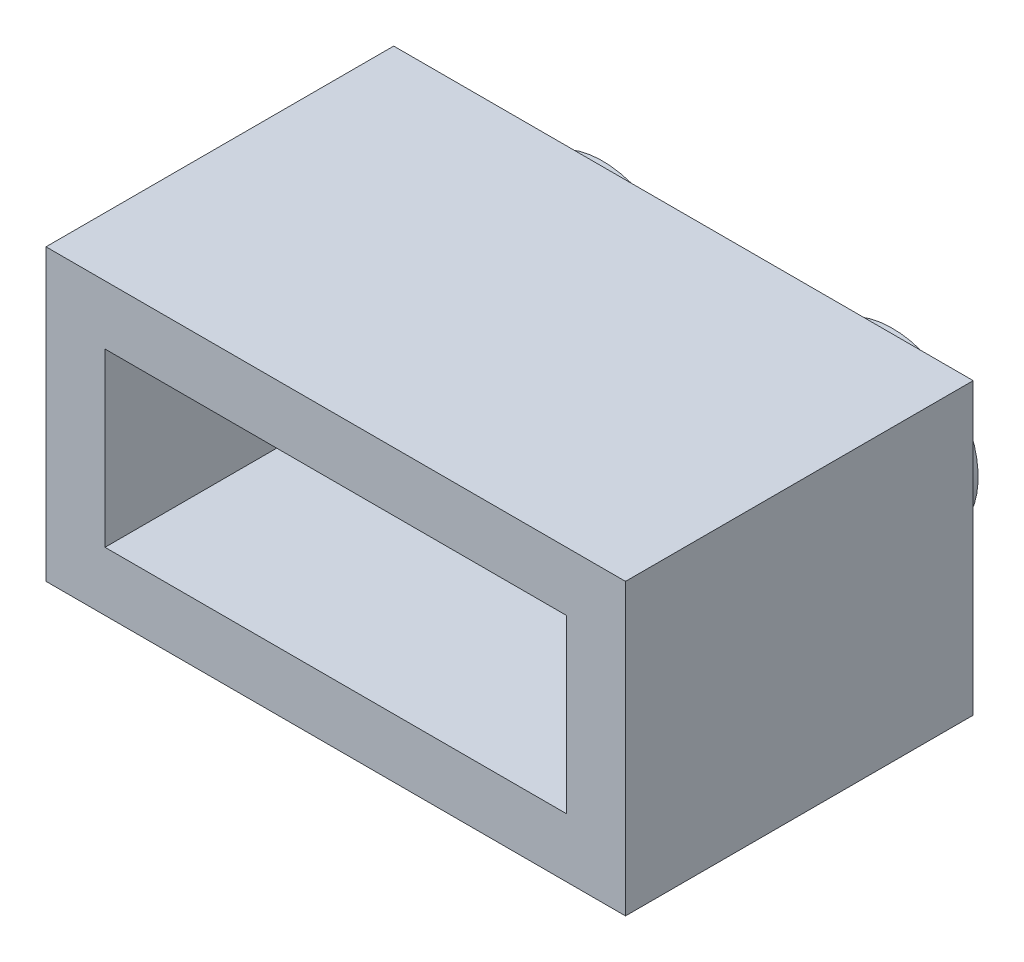
ISO-10303-21;
HEADER;
FILE_DESCRIPTION(('STEP AP214'),'2;1');
FILE_NAME('part.step','',(''),(''),'','','');
FILE_SCHEMA(('AUTOMOTIVE_DESIGN { 1 0 10303 214 1 1 1 1 }'));
ENDSEC;
DATA;
#1=APPLICATION_CONTEXT('core data for automotive mechanical design processes');
#2=APPLICATION_PROTOCOL_DEFINITION('international standard','automotive_design',2000,#1);
#3=PRODUCT_CONTEXT('',#1,'mechanical');
#4=PRODUCT('Part','Part','',(#3));
#5=PRODUCT_RELATED_PRODUCT_CATEGORY('part','',(#4));
#6=PRODUCT_DEFINITION_FORMATION('','',#4);
#7=PRODUCT_DEFINITION_CONTEXT('part definition',#1,'design');
#8=PRODUCT_DEFINITION('design','',#6,#7);
#9=PRODUCT_DEFINITION_SHAPE('','',#8);
#10=(LENGTH_UNIT() NAMED_UNIT(*) SI_UNIT(.MILLI.,.METRE.));
#11=(NAMED_UNIT(*) PLANE_ANGLE_UNIT() SI_UNIT($,.RADIAN.));
#12=(NAMED_UNIT(*) SI_UNIT($,.STERADIAN.) SOLID_ANGLE_UNIT());
#13=UNCERTAINTY_MEASURE_WITH_UNIT(LENGTH_MEASURE(1.E-05),#10,'distance_accuracy_value','');
#14=(GEOMETRIC_REPRESENTATION_CONTEXT(3) GLOBAL_UNCERTAINTY_ASSIGNED_CONTEXT((#13)) GLOBAL_UNIT_ASSIGNED_CONTEXT((#10,
#11,#12)) REPRESENTATION_CONTEXT('',''));
#15=CARTESIAN_POINT('',(0.,0.,0.));
#16=DIRECTION('',(0.,0.,1.));
#17=DIRECTION('',(1.,0.,0.));
#18=AXIS2_PLACEMENT_3D('',#15,#16,#17);
#19=CARTESIAN_POINT('',(8.065,-4.0325,-4.839));
#20=DIRECTION('',(0.,0.,-1.));
#21=DIRECTION('',(-1.,0.,0.));
#22=AXIS2_PLACEMENT_3D('',#19,#20,#21);
#23=PLANE('',#22);
#24=CARTESIAN_POINT('',(-4.0325,0.,-4.839));
#25=DIRECTION('',(0.,0.,-1.));
#26=DIRECTION('',(-1.,0.,0.));
#27=AXIS2_PLACEMENT_3D('',#24,#25,#26);
#28=CIRCLE('',#27,1.6425);
#29=CARTESIAN_POINT('',(-5.675,0.,-4.839));
#30=VERTEX_POINT('',#29);
#31=EDGE_CURVE('E19',#30,#30,#28,.T.);
#32=ORIENTED_EDGE('',*,*,#31,.T.);
#33=EDGE_LOOP('',(#32));
#34=FACE_BOUND('',#33,.T.);
#35=ADVANCED_FACE('F16',(#34),#23,.T.);
#36=CARTESIAN_POINT('',(8.065,-4.0325,-4.839));
#37=DIRECTION('',(0.,0.,-1.));
#38=DIRECTION('',(-1.,0.,0.));
#39=AXIS2_PLACEMENT_3D('',#36,#37,#38);
#40=PLANE('',#39);
#41=CARTESIAN_POINT('',(4.0325,0.,-4.839));
#42=DIRECTION('',(0.,0.,-1.));
#43=DIRECTION('',(-1.,0.,0.));
#44=AXIS2_PLACEMENT_3D('',#41,#42,#43);
#45=CIRCLE('',#44,1.6425);
#46=CARTESIAN_POINT('',(2.39,0.,-4.839));
#47=VERTEX_POINT('',#46);
#48=EDGE_CURVE('E122',#47,#47,#45,.T.);
#49=ORIENTED_EDGE('',*,*,#48,.T.);
#50=EDGE_LOOP('',(#49));
#51=FACE_BOUND('',#50,.T.);
#52=ADVANCED_FACE('F133',(#51),#40,.T.);
#53=CARTESIAN_POINT('',(-4.0325,0.,-4.839));
#54=DIRECTION('',(0.,0.,-1.));
#55=DIRECTION('',(-1.,0.,0.));
#56=AXIS2_PLACEMENT_3D('',#53,#54,#55);
#57=CYLINDRICAL_SURFACE('',#56,1.6425);
#58=CARTESIAN_POINT('',(-4.0325,0.,-6.619));
#59=DIRECTION('',(0.,0.,-1.));
#60=DIRECTION('',(-1.,0.,0.));
#61=AXIS2_PLACEMENT_3D('',#58,#59,#60);
#62=CIRCLE('',#61,1.6425);
#63=CARTESIAN_POINT('',(-5.675,0.,-6.619));
#64=VERTEX_POINT('',#63);
#65=EDGE_CURVE('E120',#64,#64,#62,.F.);
#66=ORIENTED_EDGE('',*,*,#65,.F.);
#67=EDGE_LOOP('',(#66));
#68=FACE_BOUND('',#67,.T.);
#69=ORIENTED_EDGE('',*,*,#31,.F.);
#70=EDGE_LOOP('',(#69));
#71=FACE_BOUND('',#70,.T.);
#72=ADVANCED_FACE('F130',(#68,#71),#57,.F.);
#73=CARTESIAN_POINT('',(4.0325,0.,-4.839));
#74=DIRECTION('',(0.,0.,-1.));
#75=DIRECTION('',(-1.,0.,0.));
#76=AXIS2_PLACEMENT_3D('',#73,#74,#75);
#77=CYLINDRICAL_SURFACE('',#76,1.6425);
#78=CARTESIAN_POINT('',(4.0325,0.,-6.619));
#79=DIRECTION('',(0.,0.,-1.));
#80=DIRECTION('',(-1.,0.,0.));
#81=AXIS2_PLACEMENT_3D('',#78,#79,#80);
#82=CIRCLE('',#81,1.6425);
#83=CARTESIAN_POINT('',(2.39,0.,-6.619));
#84=VERTEX_POINT('',#83);
#85=EDGE_CURVE('E93',#84,#84,#82,.F.);
#86=ORIENTED_EDGE('',*,*,#85,.F.);
#87=EDGE_LOOP('',(#86));
#88=FACE_BOUND('',#87,.T.);
#89=ORIENTED_EDGE('',*,*,#48,.F.);
#90=EDGE_LOOP('',(#89));
#91=FACE_BOUND('',#90,.T.);
#92=ADVANCED_FACE('F132',(#88,#91),#77,.F.);
#93=CARTESIAN_POINT('',(8.065,-4.0325,-3.1965));
#94=DIRECTION('',(0.,0.,-1.));
#95=DIRECTION('',(-1.,0.,0.));
#96=AXIS2_PLACEMENT_3D('',#93,#94,#95);
#97=PLANE('',#96);
#98=DIRECTION('',(1.,0.,0.));
#99=VECTOR('',#98,1.);
#100=CARTESIAN_POINT('',(0.,2.39,-3.1965));
#101=LINE('',#100,#99);
#102=CARTESIAN_POINT('',(6.4225,2.39,-3.1965));
#103=VERTEX_POINT('',#102);
#104=CARTESIAN_POINT('',(-6.4225,2.39,-3.1965));
#105=VERTEX_POINT('',#104);
#106=EDGE_CURVE('E78',#103,#105,#101,.F.);
#107=ORIENTED_EDGE('',*,*,#106,.T.);
#108=DIRECTION('',(0.,1.,0.));
#109=VECTOR('',#108,1.);
#110=CARTESIAN_POINT('',(-6.4225,-4.0325,-3.1965));
#111=LINE('',#110,#109);
#112=CARTESIAN_POINT('',(-6.4225,-2.39,-3.1965));
#113=VERTEX_POINT('',#112);
#114=EDGE_CURVE('E85',#105,#113,#111,.F.);
#115=ORIENTED_EDGE('',*,*,#114,.T.);
#116=DIRECTION('',(1.,0.,0.));
#117=VECTOR('',#116,1.);
#118=CARTESIAN_POINT('',(0.,-2.39,-3.1965));
#119=LINE('',#118,#117);
#120=CARTESIAN_POINT('',(6.4225,-2.39,-3.1965));
#121=VERTEX_POINT('',#120);
#122=EDGE_CURVE('E362',#121,#113,#119,.F.);
#123=ORIENTED_EDGE('',*,*,#122,.F.);
#124=DIRECTION('',(0.,1.,0.));
#125=VECTOR('',#124,1.);
#126=CARTESIAN_POINT('',(6.4225,-4.0325,-3.1965));
#127=LINE('',#126,#125);
#128=EDGE_CURVE('E97',#121,#103,#127,.T.);
#129=ORIENTED_EDGE('',*,*,#128,.T.);
#130=EDGE_LOOP('',(#107,#115,#123,#129));
#131=FACE_BOUND('',#130,.T.);
#132=ADVANCED_FACE('F100',(#131),#97,.F.);
#133=CARTESIAN_POINT('',(0.,-4.0325,-6.619));
#134=DIRECTION('',(0.,0.,-1.));
#135=DIRECTION('',(-1.,0.,0.));
#136=AXIS2_PLACEMENT_3D('',#133,#134,#135);
#137=PLANE('',#136);
#138=ORIENTED_EDGE('',*,*,#65,.T.);
#139=EDGE_LOOP('',(#138));
#140=FACE_BOUND('',#139,.T.);
#141=CARTESIAN_POINT('',(-4.0325,0.,-6.619));
#142=DIRECTION('',(0.,0.,-1.));
#143=DIRECTION('',(-1.,0.,0.));
#144=AXIS2_PLACEMENT_3D('',#141,#142,#143);
#145=CIRCLE('',#144,2.39);
#146=CARTESIAN_POINT('',(-6.4225,0.,-6.619));
#147=VERTEX_POINT('',#146);
#148=EDGE_CURVE('E115',#147,#147,#145,.F.);
#149=ORIENTED_EDGE('',*,*,#148,.F.);
#150=EDGE_LOOP('',(#149));
#151=FACE_BOUND('',#150,.T.);
#152=ADVANCED_FACE('F195',(#140,#151),#137,.T.);
#153=CARTESIAN_POINT('',(0.,-4.0325,-6.619));
#154=DIRECTION('',(0.,0.,-1.));
#155=DIRECTION('',(-1.,0.,0.));
#156=AXIS2_PLACEMENT_3D('',#153,#154,#155);
#157=PLANE('',#156);
#158=ORIENTED_EDGE('',*,*,#85,.T.);
#159=EDGE_LOOP('',(#158));
#160=FACE_BOUND('',#159,.T.);
#161=CARTESIAN_POINT('',(4.0325,0.,-6.619));
#162=DIRECTION('',(0.,0.,-1.));
#163=DIRECTION('',(-1.,0.,0.));
#164=AXIS2_PLACEMENT_3D('',#161,#162,#163);
#165=CIRCLE('',#164,2.39);
#166=CARTESIAN_POINT('',(1.6425,0.,-6.619));
#167=VERTEX_POINT('',#166);
#168=EDGE_CURVE('E111',#167,#167,#165,.F.);
#169=ORIENTED_EDGE('',*,*,#168,.F.);
#170=EDGE_LOOP('',(#169));
#171=FACE_BOUND('',#170,.T.);
#172=ADVANCED_FACE('F192',(#160,#171),#157,.T.);
#173=CARTESIAN_POINT('',(-6.4225,-4.0325,-4.839));
#174=DIRECTION('',(-1.,0.,0.));
#175=DIRECTION('',(0.,0.,1.));
#176=AXIS2_PLACEMENT_3D('',#173,#174,#175);
#177=PLANE('',#176);
#178=ORIENTED_EDGE('',*,*,#114,.F.);
#179=DIRECTION('',(0.,0.,1.));
#180=VECTOR('',#179,1.);
#181=CARTESIAN_POINT('',(-6.4225,2.39,0.));
#182=LINE('',#181,#180);
#183=CARTESIAN_POINT('',(-6.4225,2.39,4.839));
#184=VERTEX_POINT('',#183);
#185=EDGE_CURVE('E88',#105,#184,#182,.T.);
#186=ORIENTED_EDGE('',*,*,#185,.T.);
#187=DIRECTION('',(0.,1.,0.));
#188=VECTOR('',#187,1.);
#189=CARTESIAN_POINT('',(-6.4225,-4.0325,4.839));
#190=LINE('',#189,#188);
#191=CARTESIAN_POINT('',(-6.4225,-2.39,4.839));
#192=VERTEX_POINT('',#191);
#193=EDGE_CURVE('E374',#192,#184,#190,.T.);
#194=ORIENTED_EDGE('',*,*,#193,.F.);
#195=DIRECTION('',(0.,0.,1.));
#196=VECTOR('',#195,1.);
#197=CARTESIAN_POINT('',(-6.4225,-2.39,0.));
#198=LINE('',#197,#196);
#199=EDGE_CURVE('E90',#113,#192,#198,.T.);
#200=ORIENTED_EDGE('',*,*,#199,.F.);
#201=EDGE_LOOP('',(#178,#186,#194,#200));
#202=FACE_BOUND('',#201,.T.);
#203=ADVANCED_FACE('F86',(#202),#177,.F.);
#204=CARTESIAN_POINT('',(0.,2.39,0.));
#205=DIRECTION('',(0.,1.,0.));
#206=DIRECTION('',(0.,0.,1.));
#207=AXIS2_PLACEMENT_3D('',#204,#205,#206);
#208=PLANE('',#207);
#209=ORIENTED_EDGE('',*,*,#106,.F.);
#210=DIRECTION('',(0.,0.,-1.));
#211=VECTOR('',#210,1.);
#212=CARTESIAN_POINT('',(6.4225,2.39,4.839));
#213=LINE('',#212,#211);
#214=CARTESIAN_POINT('',(6.4225,2.39,4.839));
#215=VERTEX_POINT('',#214);
#216=EDGE_CURVE('E361',#103,#215,#213,.F.);
#217=ORIENTED_EDGE('',*,*,#216,.T.);
#218=DIRECTION('',(1.,0.,0.));
#219=VECTOR('',#218,1.);
#220=CARTESIAN_POINT('',(-8.065,2.39,4.839));
#221=LINE('',#220,#219);
#222=EDGE_CURVE('E96',#184,#215,#221,.T.);
#223=ORIENTED_EDGE('',*,*,#222,.F.);
#224=ORIENTED_EDGE('',*,*,#185,.F.);
#225=EDGE_LOOP('',(#209,#217,#223,#224));
#226=FACE_BOUND('',#225,.T.);
#227=ADVANCED_FACE('F95',(#226),#208,.F.);
#228=CARTESIAN_POINT('',(6.4225,-4.0325,4.839));
#229=DIRECTION('',(1.,0.,0.));
#230=DIRECTION('',(0.,0.,-1.));
#231=AXIS2_PLACEMENT_3D('',#228,#229,#230);
#232=PLANE('',#231);
#233=ORIENTED_EDGE('',*,*,#128,.F.);
#234=DIRECTION('',(0.,0.,1.));
#235=VECTOR('',#234,1.);
#236=CARTESIAN_POINT('',(6.4225,-2.39,0.));
#237=LINE('',#236,#235);
#238=CARTESIAN_POINT('',(6.4225,-2.39,4.839));
#239=VERTEX_POINT('',#238);
#240=EDGE_CURVE('E359',#239,#121,#237,.F.);
#241=ORIENTED_EDGE('',*,*,#240,.F.);
#242=DIRECTION('',(0.,1.,0.));
#243=VECTOR('',#242,1.);
#244=CARTESIAN_POINT('',(6.4225,-4.0325,4.839));
#245=LINE('',#244,#243);
#246=EDGE_CURVE('E370',#215,#239,#245,.F.);
#247=ORIENTED_EDGE('',*,*,#246,.F.);
#248=ORIENTED_EDGE('',*,*,#216,.F.);
#249=EDGE_LOOP('',(#233,#241,#247,#248));
#250=FACE_BOUND('',#249,.T.);
#251=ADVANCED_FACE('F183',(#250),#232,.F.);
#252=CARTESIAN_POINT('',(0.,-2.39,0.));
#253=DIRECTION('',(0.,1.,0.));
#254=DIRECTION('',(0.,0.,1.));
#255=AXIS2_PLACEMENT_3D('',#252,#253,#254);
#256=PLANE('',#255);
#257=ORIENTED_EDGE('',*,*,#199,.T.);
#258=DIRECTION('',(1.,0.,0.));
#259=VECTOR('',#258,1.);
#260=CARTESIAN_POINT('',(-8.065,-2.39,4.839));
#261=LINE('',#260,#259);
#262=EDGE_CURVE('E364',#239,#192,#261,.F.);
#263=ORIENTED_EDGE('',*,*,#262,.F.);
#264=ORIENTED_EDGE('',*,*,#240,.T.);
#265=ORIENTED_EDGE('',*,*,#122,.T.);
#266=EDGE_LOOP('',(#257,#263,#264,#265));
#267=FACE_BOUND('',#266,.T.);
#268=ADVANCED_FACE('F179',(#267),#256,.T.);
#269=CARTESIAN_POINT('',(0.,4.0325,0.));
#270=DIRECTION('',(0.,1.,0.));
#271=DIRECTION('',(0.,0.,1.));
#272=AXIS2_PLACEMENT_3D('',#269,#270,#271);
#273=PLANE('',#272);
#274=DIRECTION('',(-1.,0.,0.));
#275=VECTOR('',#274,1.);
#276=CARTESIAN_POINT('',(8.065,4.0325,-4.839));
#277=LINE('',#276,#275);
#278=CARTESIAN_POINT('',(-8.065,4.0325,-4.839));
#279=VERTEX_POINT('',#278);
#280=CARTESIAN_POINT('',(8.065,4.0325,-4.839));
#281=VERTEX_POINT('',#280);
#282=EDGE_CURVE('E390',#279,#281,#277,.F.);
#283=ORIENTED_EDGE('',*,*,#282,.F.);
#284=DIRECTION('',(0.,0.,1.));
#285=VECTOR('',#284,1.);
#286=CARTESIAN_POINT('',(-8.065,4.0325,-4.839));
#287=LINE('',#286,#285);
#288=CARTESIAN_POINT('',(-8.065,4.0325,4.839));
#289=VERTEX_POINT('',#288);
#290=EDGE_CURVE('E114',#289,#279,#287,.F.);
#291=ORIENTED_EDGE('',*,*,#290,.F.);
#292=DIRECTION('',(1.,0.,0.));
#293=VECTOR('',#292,1.);
#294=CARTESIAN_POINT('',(-8.065,4.0325,4.839));
#295=LINE('',#294,#293);
#296=CARTESIAN_POINT('',(8.065,4.0325,4.839));
#297=VERTEX_POINT('',#296);
#298=EDGE_CURVE('E381',#297,#289,#295,.F.);
#299=ORIENTED_EDGE('',*,*,#298,.F.);
#300=DIRECTION('',(0.,0.,-1.));
#301=VECTOR('',#300,1.);
#302=CARTESIAN_POINT('',(8.065,4.0325,4.839));
#303=LINE('',#302,#301);
#304=EDGE_CURVE('E372',#281,#297,#303,.F.);
#305=ORIENTED_EDGE('',*,*,#304,.F.);
#306=EDGE_LOOP('',(#283,#291,#299,#305));
#307=FACE_BOUND('',#306,.T.);
#308=ADVANCED_FACE('F175',(#307),#273,.T.);
#309=CARTESIAN_POINT('',(-4.0325,0.,-4.839));
#310=DIRECTION('',(0.,0.,-1.));
#311=DIRECTION('',(-1.,0.,0.));
#312=AXIS2_PLACEMENT_3D('',#309,#310,#311);
#313=CYLINDRICAL_SURFACE('',#312,2.39);
#314=ORIENTED_EDGE('',*,*,#148,.T.);
#315=EDGE_LOOP('',(#314));
#316=FACE_BOUND('',#315,.T.);
#317=CARTESIAN_POINT('',(-4.0325,0.,-4.839));
#318=DIRECTION('',(0.,0.,-1.));
#319=DIRECTION('',(-1.,0.,0.));
#320=AXIS2_PLACEMENT_3D('',#317,#318,#319);
#321=CIRCLE('',#320,2.39);
#322=CARTESIAN_POINT('',(-6.4225,0.,-4.839));
#323=VERTEX_POINT('',#322);
#324=EDGE_CURVE('E108',#323,#323,#321,.F.);
#325=ORIENTED_EDGE('',*,*,#324,.F.);
#326=EDGE_LOOP('',(#325));
#327=FACE_BOUND('',#326,.T.);
#328=ADVANCED_FACE('F171',(#316,#327),#313,.T.);
#329=CARTESIAN_POINT('',(4.0325,0.,-4.839));
#330=DIRECTION('',(0.,0.,-1.));
#331=DIRECTION('',(-1.,0.,0.));
#332=AXIS2_PLACEMENT_3D('',#329,#330,#331);
#333=CYLINDRICAL_SURFACE('',#332,2.39);
#334=ORIENTED_EDGE('',*,*,#168,.T.);
#335=EDGE_LOOP('',(#334));
#336=FACE_BOUND('',#335,.T.);
#337=CARTESIAN_POINT('',(4.0325,0.,-4.839));
#338=DIRECTION('',(0.,0.,-1.));
#339=DIRECTION('',(-1.,0.,0.));
#340=AXIS2_PLACEMENT_3D('',#337,#338,#339);
#341=CIRCLE('',#340,2.39);
#342=CARTESIAN_POINT('',(1.6425,0.,-4.839));
#343=VERTEX_POINT('',#342);
#344=EDGE_CURVE('E104',#343,#343,#341,.F.);
#345=ORIENTED_EDGE('',*,*,#344,.F.);
#346=EDGE_LOOP('',(#345));
#347=FACE_BOUND('',#346,.T.);
#348=ADVANCED_FACE('F167',(#336,#347),#333,.T.);
#349=CARTESIAN_POINT('',(-8.065,-4.0325,-4.839));
#350=DIRECTION('',(-1.,0.,0.));
#351=DIRECTION('',(0.,0.,1.));
#352=AXIS2_PLACEMENT_3D('',#349,#350,#351);
#353=PLANE('',#352);
#354=DIRECTION('',(0.,1.,0.));
#355=VECTOR('',#354,1.);
#356=CARTESIAN_POINT('',(-8.065,-4.0325,-4.839));
#357=LINE('',#356,#355);
#358=CARTESIAN_POINT('',(-8.065,-4.0325,-4.839));
#359=VERTEX_POINT('',#358);
#360=EDGE_CURVE('E387',#359,#279,#357,.T.);
#361=ORIENTED_EDGE('',*,*,#360,.F.);
#362=DIRECTION('',(0.,0.,1.));
#363=VECTOR('',#362,1.);
#364=CARTESIAN_POINT('',(-8.065,-4.0325,0.));
#365=LINE('',#364,#363);
#366=CARTESIAN_POINT('',(-8.065,-4.0325,4.839));
#367=VERTEX_POINT('',#366);
#368=EDGE_CURVE('E107',#359,#367,#365,.T.);
#369=ORIENTED_EDGE('',*,*,#368,.T.);
#370=DIRECTION('',(0.,1.,0.));
#371=VECTOR('',#370,1.);
#372=CARTESIAN_POINT('',(-8.065,-4.0325,4.839));
#373=LINE('',#372,#371);
#374=EDGE_CURVE('E379',#289,#367,#373,.F.);
#375=ORIENTED_EDGE('',*,*,#374,.F.);
#376=ORIENTED_EDGE('',*,*,#290,.T.);
#377=EDGE_LOOP('',(#361,#369,#375,#376));
#378=FACE_BOUND('',#377,.T.);
#379=ADVANCED_FACE('F163',(#378),#353,.T.);
#380=CARTESIAN_POINT('',(-8.065,-4.0325,4.839));
#381=DIRECTION('',(0.,0.,1.));
#382=DIRECTION('',(1.,0.,0.));
#383=AXIS2_PLACEMENT_3D('',#380,#381,#382);
#384=PLANE('',#383);
#385=ORIENTED_EDGE('',*,*,#246,.T.);
#386=ORIENTED_EDGE('',*,*,#262,.T.);
#387=ORIENTED_EDGE('',*,*,#193,.T.);
#388=ORIENTED_EDGE('',*,*,#222,.T.);
#389=EDGE_LOOP('',(#385,#386,#387,#388));
#390=FACE_BOUND('',#389,.T.);
#391=ORIENTED_EDGE('',*,*,#374,.T.);
#392=DIRECTION('',(1.,0.,0.));
#393=VECTOR('',#392,1.);
#394=CARTESIAN_POINT('',(0.,-4.0325,4.839));
#395=LINE('',#394,#393);
#396=CARTESIAN_POINT('',(8.065,-4.0325,4.839));
#397=VERTEX_POINT('',#396);
#398=EDGE_CURVE('E403',#367,#397,#395,.T.);
#399=ORIENTED_EDGE('',*,*,#398,.T.);
#400=DIRECTION('',(0.,1.,0.));
#401=VECTOR('',#400,1.);
#402=CARTESIAN_POINT('',(8.065,-4.0325,4.839));
#403=LINE('',#402,#401);
#404=EDGE_CURVE('E392',#297,#397,#403,.F.);
#405=ORIENTED_EDGE('',*,*,#404,.F.);
#406=ORIENTED_EDGE('',*,*,#298,.T.);
#407=EDGE_LOOP('',(#391,#399,#405,#406));
#408=FACE_BOUND('',#407,.T.);
#409=ADVANCED_FACE('F159',(#390,#408),#384,.T.);
#410=CARTESIAN_POINT('',(8.065,-4.0325,4.839));
#411=DIRECTION('',(1.,0.,0.));
#412=DIRECTION('',(0.,0.,-1.));
#413=AXIS2_PLACEMENT_3D('',#410,#411,#412);
#414=PLANE('',#413);
#415=ORIENTED_EDGE('',*,*,#404,.T.);
#416=DIRECTION('',(0.,0.,1.));
#417=VECTOR('',#416,1.);
#418=CARTESIAN_POINT('',(8.065,-4.0325,0.));
#419=LINE('',#418,#417);
#420=CARTESIAN_POINT('',(8.065,-4.0325,-4.839));
#421=VERTEX_POINT('',#420);
#422=EDGE_CURVE('E25',#397,#421,#419,.F.);
#423=ORIENTED_EDGE('',*,*,#422,.T.);
#424=DIRECTION('',(0.,1.,0.));
#425=VECTOR('',#424,1.);
#426=CARTESIAN_POINT('',(8.065,-4.0325,-4.839));
#427=LINE('',#426,#425);
#428=EDGE_CURVE('E33',#281,#421,#427,.F.);
#429=ORIENTED_EDGE('',*,*,#428,.F.);
#430=ORIENTED_EDGE('',*,*,#304,.T.);
#431=EDGE_LOOP('',(#415,#423,#429,#430));
#432=FACE_BOUND('',#431,.T.);
#433=ADVANCED_FACE('F152',(#432),#414,.T.);
#434=CARTESIAN_POINT('',(8.065,-4.0325,-4.839));
#435=DIRECTION('',(0.,0.,-1.));
#436=DIRECTION('',(-1.,0.,0.));
#437=AXIS2_PLACEMENT_3D('',#434,#435,#436);
#438=PLANE('',#437);
#439=ORIENTED_EDGE('',*,*,#344,.T.);
#440=EDGE_LOOP('',(#439));
#441=FACE_BOUND('',#440,.T.);
#442=ORIENTED_EDGE('',*,*,#324,.T.);
#443=EDGE_LOOP('',(#442));
#444=FACE_BOUND('',#443,.T.);
#445=ORIENTED_EDGE('',*,*,#428,.T.);
#446=DIRECTION('',(1.,0.,0.));
#447=VECTOR('',#446,1.);
#448=CARTESIAN_POINT('',(0.,-4.0325,-4.839));
#449=LINE('',#448,#447);
#450=EDGE_CURVE('E10',#421,#359,#449,.F.);
#451=ORIENTED_EDGE('',*,*,#450,.T.);
#452=ORIENTED_EDGE('',*,*,#360,.T.);
#453=ORIENTED_EDGE('',*,*,#282,.T.);
#454=EDGE_LOOP('',(#445,#451,#452,#453));
#455=FACE_BOUND('',#454,.T.);
#456=ADVANCED_FACE('F146',(#441,#444,#455),#438,.T.);
#457=CARTESIAN_POINT('',(0.,-4.0325,0.));
#458=DIRECTION('',(0.,1.,0.));
#459=DIRECTION('',(0.,0.,1.));
#460=AXIS2_PLACEMENT_3D('',#457,#458,#459);
#461=PLANE('',#460);
#462=ORIENTED_EDGE('',*,*,#422,.F.);
#463=ORIENTED_EDGE('',*,*,#398,.F.);
#464=ORIENTED_EDGE('',*,*,#368,.F.);
#465=ORIENTED_EDGE('',*,*,#450,.F.);
#466=EDGE_LOOP('',(#462,#463,#464,#465));
#467=FACE_BOUND('',#466,.T.);
#468=ADVANCED_FACE('F144',(#467),#461,.F.);
#469=CLOSED_SHELL('',(#35,#52,#72,#92,#132,#152,#172,#203,#227,#251,#268,#308,#328,#348,#379,
#409,#433,#456,#468));
#470=MANIFOLD_SOLID_BREP('B1',#469);
#471=ADVANCED_BREP_SHAPE_REPRESENTATION('',(#18,#470),#14);
#472=SHAPE_DEFINITION_REPRESENTATION(#9,#471);
ENDSEC;
END-ISO-10303-21;
